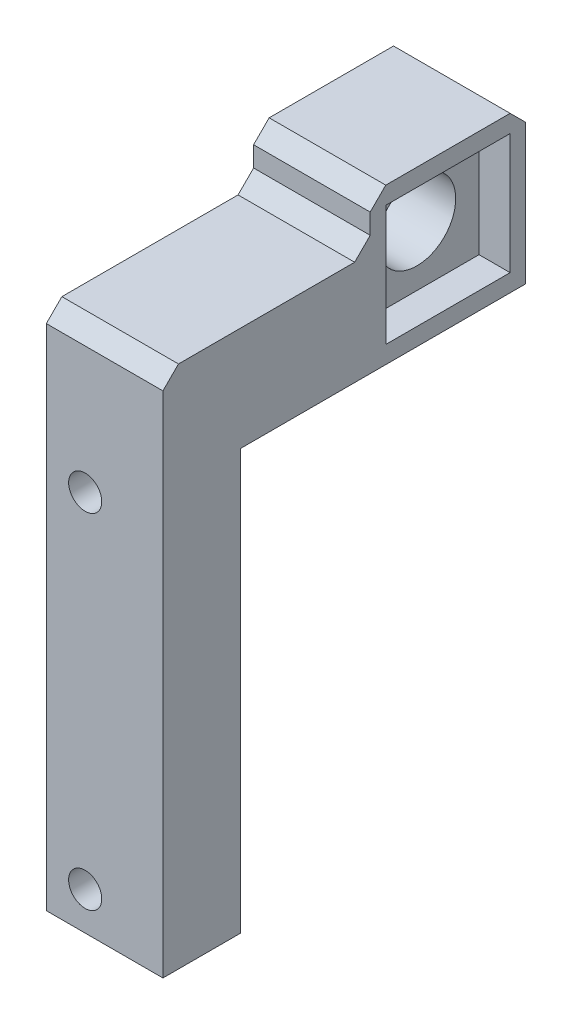
ISO-10303-21;
HEADER;
FILE_DESCRIPTION(('STEP AP214'),'2;1');
FILE_NAME('part.step','',(''),(''),'','','');
FILE_SCHEMA(('AUTOMOTIVE_DESIGN { 1 0 10303 214 1 1 1 1 }'));
ENDSEC;
DATA;
#1=APPLICATION_CONTEXT('core data for automotive mechanical design processes');
#2=APPLICATION_PROTOCOL_DEFINITION('international standard','automotive_design',2000,#1);
#3=PRODUCT_CONTEXT('',#1,'mechanical');
#4=PRODUCT('Part','Part','',(#3));
#5=PRODUCT_RELATED_PRODUCT_CATEGORY('part','',(#4));
#6=PRODUCT_DEFINITION_FORMATION('','',#4);
#7=PRODUCT_DEFINITION_CONTEXT('part definition',#1,'design');
#8=PRODUCT_DEFINITION('design','',#6,#7);
#9=PRODUCT_DEFINITION_SHAPE('','',#8);
#10=(LENGTH_UNIT() NAMED_UNIT(*) SI_UNIT(.MILLI.,.METRE.));
#11=(NAMED_UNIT(*) PLANE_ANGLE_UNIT() SI_UNIT($,.RADIAN.));
#12=(NAMED_UNIT(*) SI_UNIT($,.STERADIAN.) SOLID_ANGLE_UNIT());
#13=UNCERTAINTY_MEASURE_WITH_UNIT(LENGTH_MEASURE(1.E-05),#10,'distance_accuracy_value','');
#14=(GEOMETRIC_REPRESENTATION_CONTEXT(3) GLOBAL_UNCERTAINTY_ASSIGNED_CONTEXT((#13)) GLOBAL_UNIT_ASSIGNED_CONTEXT((#10,
#11,#12)) REPRESENTATION_CONTEXT('',''));
#15=CARTESIAN_POINT('',(0.,0.,0.));
#16=DIRECTION('',(0.,0.,1.));
#17=DIRECTION('',(1.,0.,0.));
#18=AXIS2_PLACEMENT_3D('',#15,#16,#17);
#19=CARTESIAN_POINT('',(0.,0.,13.406799165578));
#20=DIRECTION('',(0.,0.,-1.));
#21=DIRECTION('',(-1.,0.,0.));
#22=AXIS2_PLACEMENT_3D('',#19,#20,#21);
#23=PLANE('',#22);
#24=CARTESIAN_POINT('',(-45.,-22.125,13.406799165578));
#25=DIRECTION('',(0.,0.,1.));
#26=DIRECTION('',(1.,0.,0.));
#27=AXIS2_PLACEMENT_3D('',#24,#25,#26);
#28=CIRCLE('',#27,2.13030000000002);
#29=CARTESIAN_POINT('',(-42.8697,-22.125,13.406799165578));
#30=VERTEX_POINT('',#29);
#31=EDGE_CURVE('E239',#30,#30,#28,.T.);
#32=ORIENTED_EDGE('',*,*,#31,.T.);
#33=EDGE_LOOP('',(#32));
#34=FACE_BOUND('',#33,.T.);
#35=DIRECTION('',(-1.,0.,0.));
#36=VECTOR('',#35,1.);
#37=CARTESIAN_POINT('',(-50.0000000000074,26.9999999999873,13.406799165578));
#38=LINE('',#37,#36);
#39=CARTESIAN_POINT('',(-35.0000000000074,26.9999999999873,13.406799165578));
#40=VERTEX_POINT('',#39);
#41=CARTESIAN_POINT('',(-50.0000000000074,26.9999999999873,13.406799165578));
#42=VERTEX_POINT('',#41);
#43=EDGE_CURVE('E242',#40,#42,#38,.T.);
#44=ORIENTED_EDGE('',*,*,#43,.F.);
#45=DIRECTION('',(0.,1.,0.));
#46=VECTOR('',#45,1.);
#47=CARTESIAN_POINT('',(-35.0000000000074,26.9999999999873,13.406799165578));
#48=LINE('',#47,#46);
#49=CARTESIAN_POINT('',(-35.0000000000074,-27.0000000000127,13.406799165578));
#50=VERTEX_POINT('',#49);
#51=EDGE_CURVE('E256',#50,#40,#48,.T.);
#52=ORIENTED_EDGE('',*,*,#51,.F.);
#53=DIRECTION('',(1.,0.,0.));
#54=VECTOR('',#53,1.);
#55=CARTESIAN_POINT('',(-50.0000000000069,-27.0000000000127,13.406799165578));
#56=LINE('',#55,#54);
#57=CARTESIAN_POINT('',(-50.0000000000069,-27.0000000000127,13.406799165578));
#58=VERTEX_POINT('',#57);
#59=EDGE_CURVE('E232',#58,#50,#56,.T.);
#60=ORIENTED_EDGE('',*,*,#59,.F.);
#61=DIRECTION('',(0.,-1.,0.));
#62=VECTOR('',#61,1.);
#63=CARTESIAN_POINT('',(-50.0000000000074,26.9999999999873,13.406799165578));
#64=LINE('',#63,#62);
#65=EDGE_CURVE('E250',#42,#58,#64,.T.);
#66=ORIENTED_EDGE('',*,*,#65,.F.);
#67=EDGE_LOOP('',(#44,#52,#60,#66));
#68=FACE_BOUND('',#67,.T.);
#69=CARTESIAN_POINT('',(-45.,22.125,13.406799165578));
#70=DIRECTION('',(0.,0.,1.));
#71=DIRECTION('',(1.,0.,0.));
#72=AXIS2_PLACEMENT_3D('',#69,#70,#71);
#73=CIRCLE('',#72,2.13030000000002);
#74=CARTESIAN_POINT('',(-42.8697,22.125,13.406799165578));
#75=VERTEX_POINT('',#74);
#76=EDGE_CURVE('E247',#75,#75,#73,.T.);
#77=ORIENTED_EDGE('',*,*,#76,.T.);
#78=EDGE_LOOP('',(#77));
#79=FACE_BOUND('',#78,.T.);
#80=ADVANCED_FACE('F33',(#34,#68,#79),#23,.T.);
#81=CARTESIAN_POINT('',(-50.0000000000074,26.9999999999873,79.4514242423865));
#82=DIRECTION('',(1.,0.,0.));
#83=DIRECTION('',(0.,1.,0.));
#84=AXIS2_PLACEMENT_3D('',#81,#82,#83);
#85=PLANE('',#84);
#86=DIRECTION('',(0.,1.,0.));
#87=VECTOR('',#86,1.);
#88=CARTESIAN_POINT('',(-50.0000000000074,26.9999999999873,23.4067991655776));
#89=LINE('',#88,#87);
#90=CARTESIAN_POINT('',(-50.0000000000069,-27.0000000000127,23.4067991655776));
#91=VERTEX_POINT('',#90);
#92=CARTESIAN_POINT('',(-50.0000000000075,38.4099403302794,23.4067991655776));
#93=VERTEX_POINT('',#92);
#94=EDGE_CURVE('E246',#91,#93,#89,.T.);
#95=ORIENTED_EDGE('',*,*,#94,.T.);
#96=DIRECTION('',(0.,0.707106781186516,-0.707106781186579));
#97=VECTOR('',#96,1.);
#98=CARTESIAN_POINT('',(-50.0000000000075,38.4099403302794,23.4067991655776));
#99=LINE('',#98,#97);
#100=CARTESIAN_POINT('',(-50.0000000000075,40.4099403302794,21.4067991655774));
#101=VERTEX_POINT('',#100);
#102=EDGE_CURVE('E56',#93,#101,#99,.T.);
#103=ORIENTED_EDGE('',*,*,#102,.T.);
#104=DIRECTION('',(0.,0.,-1.));
#105=VECTOR('',#104,1.);
#106=CARTESIAN_POINT('',(-50.0000000000075,40.4099403302794,23.4067991655776));
#107=LINE('',#106,#105);
#108=CARTESIAN_POINT('',(-50.0000000000075,40.4099403302794,-1.25767630333836));
#109=VERTEX_POINT('',#108);
#110=EDGE_CURVE('E220',#101,#109,#107,.T.);
#111=ORIENTED_EDGE('',*,*,#110,.T.);
#112=DIRECTION('',(0.,-0.707106781186543,0.707106781186552));
#113=VECTOR('',#112,1.);
#114=CARTESIAN_POINT('',(-50.0000000000071,-6.64958010772894,45.8018441346707));
#115=LINE('',#114,#113);
#116=CARTESIAN_POINT('',(-50.0000000000071,42.4099403302794,-3.2576763033384));
#117=VERTEX_POINT('',#116);
#118=EDGE_CURVE('E41',#109,#117,#115,.F.);
#119=ORIENTED_EDGE('',*,*,#118,.T.);
#120=DIRECTION('',(0.,1.,0.));
#121=VECTOR('',#120,1.);
#122=CARTESIAN_POINT('',(-50.0000000000071,26.9999999999892,-3.2576763033384));
#123=LINE('',#122,#121);
#124=CARTESIAN_POINT('',(-50.0000000000073,44.9999999999892,-3.25767630333839));
#125=VERTEX_POINT('',#124);
#126=EDGE_CURVE('E194',#117,#125,#123,.T.);
#127=ORIENTED_EDGE('',*,*,#126,.T.);
#128=DIRECTION('',(0.,-0.707106781186545,0.70710678118655));
#129=VECTOR('',#128,1.);
#130=CARTESIAN_POINT('',(-50.0000000000075,44.9999999999892,-3.25767630333833));
#131=LINE('',#130,#129);
#132=CARTESIAN_POINT('',(-50.0000000000071,46.9999999999892,-5.2576763033384));
#133=VERTEX_POINT('',#132);
#134=EDGE_CURVE('E289',#125,#133,#131,.F.);
#135=ORIENTED_EDGE('',*,*,#134,.T.);
#136=DIRECTION('',(0.,0.,-1.));
#137=VECTOR('',#136,1.);
#138=CARTESIAN_POINT('',(-50.0000000000071,46.9999999999892,-3.2576763033384));
#139=LINE('',#138,#137);
#140=CARTESIAN_POINT('',(-50.0000000000073,46.9999999999892,-21.2576763033384));
#141=VERTEX_POINT('',#140);
#142=EDGE_CURVE('E208',#133,#141,#139,.T.);
#143=ORIENTED_EDGE('',*,*,#142,.T.);
#144=DIRECTION('',(0.,0.70710678118655,0.707106781186545));
#145=VECTOR('',#144,1.);
#146=CARTESIAN_POINT('',(-50.0000000000075,46.9999999999892,-21.2576763033385));
#147=LINE('',#146,#145);
#148=CARTESIAN_POINT('',(-50.0000000000071,44.9999999999892,-23.2576763033384));
#149=VERTEX_POINT('',#148);
#150=EDGE_CURVE('E287',#141,#149,#147,.F.);
#151=ORIENTED_EDGE('',*,*,#150,.T.);
#152=DIRECTION('',(0.,-1.,0.));
#153=VECTOR('',#152,1.);
#154=CARTESIAN_POINT('',(-50.0000000000071,26.9999999999892,-23.2576763033384));
#155=LINE('',#154,#153);
#156=CARTESIAN_POINT('',(-50.0000000000071,26.9999999999892,-23.2576763033384));
#157=VERTEX_POINT('',#156);
#158=EDGE_CURVE('E203',#149,#157,#155,.T.);
#159=ORIENTED_EDGE('',*,*,#158,.T.);
#160=DIRECTION('',(0.,0.,1.));
#161=VECTOR('',#160,1.);
#162=CARTESIAN_POINT('',(-50.0000000000074,26.9999999999873,23.4067991655776));
#163=LINE('',#162,#161);
#164=EDGE_CURVE('E229',#157,#42,#163,.T.);
#165=ORIENTED_EDGE('',*,*,#164,.T.);
#166=ORIENTED_EDGE('',*,*,#65,.T.);
#167=DIRECTION('',(0.,0.,-1.));
#168=VECTOR('',#167,1.);
#169=CARTESIAN_POINT('',(-50.0000000000069,-27.0000000000127,79.4514242423865));
#170=LINE('',#169,#168);
#171=EDGE_CURVE('E236',#91,#58,#170,.T.);
#172=ORIENTED_EDGE('',*,*,#171,.F.);
#173=EDGE_LOOP('',(#95,#103,#111,#119,#127,#135,#143,#151,#159,#165,#166,#172));
#174=FACE_BOUND('',#173,.T.);
#175=CARTESIAN_POINT('',(-50.0000000000071,36.9999999999892,-13.2576763033384));
#176=DIRECTION('',(-1.,0.,0.));
#177=DIRECTION('',(0.,0.,1.));
#178=AXIS2_PLACEMENT_3D('',#175,#176,#177);
#179=CIRCLE('',#178,4.99999999999975);
#180=CARTESIAN_POINT('',(-50.0000000000071,36.9999999999892,-8.25767630333865));
#181=VERTEX_POINT('',#180);
#182=EDGE_CURVE('E191',#181,#181,#179,.T.);
#183=ORIENTED_EDGE('',*,*,#182,.F.);
#184=EDGE_LOOP('',(#183));
#185=FACE_BOUND('',#184,.T.);
#186=ADVANCED_FACE('F313',(#174,#185),#85,.F.);
#187=CARTESIAN_POINT('',(-50.0000000000069,-27.0000000000127,79.4514242423865));
#188=DIRECTION('',(0.,1.,0.));
#189=DIRECTION('',(0.,0.,1.));
#190=AXIS2_PLACEMENT_3D('',#187,#188,#189);
#191=PLANE('',#190);
#192=DIRECTION('',(0.,0.,-1.));
#193=VECTOR('',#192,1.);
#194=CARTESIAN_POINT('',(-35.0000000000074,-27.0000000000127,79.4514242423865));
#195=LINE('',#194,#193);
#196=CARTESIAN_POINT('',(-35.0000000000074,-27.0000000000127,23.4067991655776));
#197=VERTEX_POINT('',#196);
#198=EDGE_CURVE('E258',#197,#50,#195,.T.);
#199=ORIENTED_EDGE('',*,*,#198,.F.);
#200=DIRECTION('',(-1.,0.,0.));
#201=VECTOR('',#200,1.);
#202=CARTESIAN_POINT('',(-50.0000000000069,-27.0000000000127,23.4067991655776));
#203=LINE('',#202,#201);
#204=EDGE_CURVE('E253',#197,#91,#203,.T.);
#205=ORIENTED_EDGE('',*,*,#204,.T.);
#206=ORIENTED_EDGE('',*,*,#171,.T.);
#207=ORIENTED_EDGE('',*,*,#59,.T.);
#208=EDGE_LOOP('',(#199,#205,#206,#207));
#209=FACE_BOUND('',#208,.T.);
#210=ADVANCED_FACE('F319',(#209),#191,.F.);
#211=CARTESIAN_POINT('',(-35.0000000000074,26.9999999999873,79.4514242423865));
#212=DIRECTION('',(-1.,0.,0.));
#213=DIRECTION('',(0.,-1.,0.));
#214=AXIS2_PLACEMENT_3D('',#211,#212,#213);
#215=PLANE('',#214);
#216=DIRECTION('',(0.,0.,-1.));
#217=VECTOR('',#216,1.);
#218=CARTESIAN_POINT('',(-35.0000000000074,29.2499999999884,-5.2576763033384));
#219=LINE('',#218,#217);
#220=CARTESIAN_POINT('',(-35.0000000000074,29.2499999999884,-5.2576763033384));
#221=VERTEX_POINT('',#220);
#222=CARTESIAN_POINT('',(-35.0000000000074,29.2499999999884,-21.2576763033384));
#223=VERTEX_POINT('',#222);
#224=EDGE_CURVE('E181',#221,#223,#219,.T.);
#225=ORIENTED_EDGE('',*,*,#224,.F.);
#226=DIRECTION('',(0.,-1.,0.));
#227=VECTOR('',#226,1.);
#228=CARTESIAN_POINT('',(-35.0000000000074,29.2499999999884,-5.2576763033384));
#229=LINE('',#228,#227);
#230=CARTESIAN_POINT('',(-35.0000000000074,44.7499999999884,-5.2576763033384));
#231=VERTEX_POINT('',#230);
#232=EDGE_CURVE('E154',#231,#221,#229,.T.);
#233=ORIENTED_EDGE('',*,*,#232,.F.);
#234=DIRECTION('',(0.,0.,1.));
#235=VECTOR('',#234,1.);
#236=CARTESIAN_POINT('',(-35.0000000000074,44.7499999999884,-5.2576763033384));
#237=LINE('',#236,#235);
#238=CARTESIAN_POINT('',(-35.0000000000074,44.7499999999884,-21.2576763033384));
#239=VERTEX_POINT('',#238);
#240=EDGE_CURVE('E172',#239,#231,#237,.T.);
#241=ORIENTED_EDGE('',*,*,#240,.F.);
#242=DIRECTION('',(0.,1.,0.));
#243=VECTOR('',#242,1.);
#244=CARTESIAN_POINT('',(-35.0000000000074,29.2499999999884,-21.2576763033384));
#245=LINE('',#244,#243);
#246=EDGE_CURVE('E175',#223,#239,#245,.T.);
#247=ORIENTED_EDGE('',*,*,#246,.F.);
#248=EDGE_LOOP('',(#225,#233,#241,#247));
#249=FACE_BOUND('',#248,.T.);
#250=DIRECTION('',(0.,0.,1.));
#251=VECTOR('',#250,1.);
#252=CARTESIAN_POINT('',(-35.0000000000074,40.4099403302796,23.4067991655776));
#253=LINE('',#252,#251);
#254=CARTESIAN_POINT('',(-35.0000000000074,40.4099403302796,-1.25767630333837));
#255=VERTEX_POINT('',#254);
#256=CARTESIAN_POINT('',(-35.0000000000074,40.4099403302796,21.4067991655774));
#257=VERTEX_POINT('',#256);
#258=EDGE_CURVE('E228',#255,#257,#253,.T.);
#259=ORIENTED_EDGE('',*,*,#258,.T.);
#260=DIRECTION('',(0.,-0.707106781186516,0.707106781186579));
#261=VECTOR('',#260,1.);
#262=CARTESIAN_POINT('',(-35.0000000000074,38.4099403302798,23.4067991655773));
#263=LINE('',#262,#261);
#264=CARTESIAN_POINT('',(-35.0000000000074,38.4099403302795,23.4067991655776));
#265=VERTEX_POINT('',#264);
#266=EDGE_CURVE('E48',#257,#265,#263,.T.);
#267=ORIENTED_EDGE('',*,*,#266,.T.);
#268=DIRECTION('',(0.,-1.,0.));
#269=VECTOR('',#268,1.);
#270=CARTESIAN_POINT('',(-35.0000000000074,26.9999999999873,23.4067991655776));
#271=LINE('',#270,#269);
#272=EDGE_CURVE('E235',#265,#197,#271,.T.);
#273=ORIENTED_EDGE('',*,*,#272,.T.);
#274=ORIENTED_EDGE('',*,*,#198,.T.);
#275=ORIENTED_EDGE('',*,*,#51,.T.);
#276=DIRECTION('',(0.,0.,-1.));
#277=VECTOR('',#276,1.);
#278=CARTESIAN_POINT('',(-35.0000000000074,26.9999999999875,23.4067991655776));
#279=LINE('',#278,#277);
#280=CARTESIAN_POINT('',(-35.0000000000071,26.9999999999892,-23.2576763033384));
#281=VERTEX_POINT('',#280);
#282=EDGE_CURVE('E225',#40,#281,#279,.T.);
#283=ORIENTED_EDGE('',*,*,#282,.T.);
#284=DIRECTION('',(0.,-1.,0.));
#285=VECTOR('',#284,1.);
#286=CARTESIAN_POINT('',(-35.0000000000071,26.9999999999892,-23.2576763033384));
#287=LINE('',#286,#285);
#288=CARTESIAN_POINT('',(-35.0000000000072,44.9999999999892,-23.2576763033384));
#289=VERTEX_POINT('',#288);
#290=EDGE_CURVE('E213',#289,#281,#287,.T.);
#291=ORIENTED_EDGE('',*,*,#290,.F.);
#292=DIRECTION('',(0.,-0.70710678118655,-0.707106781186545));
#293=VECTOR('',#292,1.);
#294=CARTESIAN_POINT('',(-35.0000000000074,46.9999999999892,-21.2576763033384));
#295=LINE('',#294,#293);
#296=CARTESIAN_POINT('',(-35.0000000000072,46.9999999999892,-21.2576763033384));
#297=VERTEX_POINT('',#296);
#298=EDGE_CURVE('E276',#289,#297,#295,.F.);
#299=ORIENTED_EDGE('',*,*,#298,.T.);
#300=DIRECTION('',(0.,0.,-1.));
#301=VECTOR('',#300,1.);
#302=CARTESIAN_POINT('',(-35.0000000000071,46.9999999999892,-3.2576763033384));
#303=LINE('',#302,#301);
#304=CARTESIAN_POINT('',(-35.0000000000072,46.9999999999892,-5.2576763033384));
#305=VERTEX_POINT('',#304);
#306=EDGE_CURVE('E197',#305,#297,#303,.T.);
#307=ORIENTED_EDGE('',*,*,#306,.F.);
#308=DIRECTION('',(0.,0.707106781186545,-0.70710678118655));
#309=VECTOR('',#308,1.);
#310=CARTESIAN_POINT('',(-35.0000000000074,44.9999999999893,-3.2576763033384));
#311=LINE('',#310,#309);
#312=CARTESIAN_POINT('',(-35.0000000000072,44.9999999999893,-3.2576763033384));
#313=VERTEX_POINT('',#312);
#314=EDGE_CURVE('E280',#305,#313,#311,.F.);
#315=ORIENTED_EDGE('',*,*,#314,.T.);
#316=DIRECTION('',(0.,1.,0.));
#317=VECTOR('',#316,1.);
#318=CARTESIAN_POINT('',(-35.0000000000071,26.9999999999892,-3.2576763033384));
#319=LINE('',#318,#317);
#320=CARTESIAN_POINT('',(-35.0000000000071,42.4099403302796,-3.2576763033384));
#321=VERTEX_POINT('',#320);
#322=EDGE_CURVE('E200',#321,#313,#319,.T.);
#323=ORIENTED_EDGE('',*,*,#322,.F.);
#324=DIRECTION('',(0.,0.707106781186543,-0.707106781186552));
#325=VECTOR('',#324,1.);
#326=CARTESIAN_POINT('',(-35.0000000000074,-6.64958010772887,45.8018441346707));
#327=LINE('',#326,#325);
#328=EDGE_CURVE('E11',#321,#255,#327,.F.);
#329=ORIENTED_EDGE('',*,*,#328,.T.);
#330=EDGE_LOOP('',(#259,#267,#273,#274,#275,#283,#291,#299,#307,#315,#323,#329));
#331=FACE_BOUND('',#330,.T.);
#332=ADVANCED_FACE('F328',(#249,#331),#215,.F.);
#333=CARTESIAN_POINT('',(-45.,-22.125,79.4514242423865));
#334=DIRECTION('',(0.,0.,-1.));
#335=DIRECTION('',(-1.,0.,0.));
#336=AXIS2_PLACEMENT_3D('',#333,#334,#335);
#337=CYLINDRICAL_SURFACE('',#336,2.13030000000002);
#338=CARTESIAN_POINT('',(-45.,-22.125,23.4067991655776));
#339=DIRECTION('',(0.,0.,-1.00000000000003));
#340=DIRECTION('',(-1.,0.,0.));
#341=AXIS2_PLACEMENT_3D('',#338,#339,#340);
#342=CIRCLE('',#341,2.13030000000002);
#343=CARTESIAN_POINT('',(-47.1303,-22.125,23.4067991655776));
#344=VERTEX_POINT('',#343);
#345=EDGE_CURVE('E295',#344,#344,#342,.T.);
#346=ORIENTED_EDGE('',*,*,#345,.F.);
#347=EDGE_LOOP('',(#346));
#348=FACE_BOUND('',#347,.T.);
#349=ORIENTED_EDGE('',*,*,#31,.F.);
#350=EDGE_LOOP('',(#349));
#351=FACE_BOUND('',#350,.T.);
#352=ADVANCED_FACE('F331',(#348,#351),#337,.F.);
#353=CARTESIAN_POINT('',(-45.,22.125,79.4514242423865));
#354=DIRECTION('',(0.,0.,-1.));
#355=DIRECTION('',(-1.,0.,0.));
#356=AXIS2_PLACEMENT_3D('',#353,#354,#355);
#357=CYLINDRICAL_SURFACE('',#356,2.13030000000002);
#358=CARTESIAN_POINT('',(-45.,22.125,23.4067991655776));
#359=DIRECTION('',(0.,0.,-1.00000000000003));
#360=DIRECTION('',(-1.,0.,0.));
#361=AXIS2_PLACEMENT_3D('',#358,#359,#360);
#362=CIRCLE('',#361,2.13030000000002);
#363=CARTESIAN_POINT('',(-47.1303,22.125,23.4067991655776));
#364=VERTEX_POINT('',#363);
#365=EDGE_CURVE('E248',#364,#364,#362,.T.);
#366=ORIENTED_EDGE('',*,*,#365,.F.);
#367=EDGE_LOOP('',(#366));
#368=FACE_BOUND('',#367,.T.);
#369=ORIENTED_EDGE('',*,*,#76,.F.);
#370=EDGE_LOOP('',(#369));
#371=FACE_BOUND('',#370,.T.);
#372=ADVANCED_FACE('F338',(#368,#371),#357,.F.);
#373=CARTESIAN_POINT('',(29.9999999999958,-27.0000000000119,23.4067991655776));
#374=DIRECTION('',(0.,0.,-1.00000000000003));
#375=DIRECTION('',(0.,-1.,0.));
#376=AXIS2_PLACEMENT_3D('',#373,#374,#375);
#377=PLANE('',#376);
#378=ORIENTED_EDGE('',*,*,#365,.T.);
#379=EDGE_LOOP('',(#378));
#380=FACE_BOUND('',#379,.T.);
#381=ORIENTED_EDGE('',*,*,#345,.T.);
#382=EDGE_LOOP('',(#381));
#383=FACE_BOUND('',#382,.T.);
#384=ORIENTED_EDGE('',*,*,#272,.F.);
#385=DIRECTION('',(-1.,0.,0.));
#386=VECTOR('',#385,1.);
#387=CARTESIAN_POINT('',(-50.0000000000075,38.4099403302794,23.4067991655776));
#388=LINE('',#387,#386);
#389=EDGE_CURVE('E384',#265,#93,#388,.T.);
#390=ORIENTED_EDGE('',*,*,#389,.T.);
#391=ORIENTED_EDGE('',*,*,#94,.F.);
#392=ORIENTED_EDGE('',*,*,#204,.F.);
#393=EDGE_LOOP('',(#384,#390,#391,#392));
#394=FACE_BOUND('',#393,.T.);
#395=ADVANCED_FACE('F342',(#380,#383,#394),#377,.F.);
#396=CARTESIAN_POINT('',(-5.15337955992369,26.9999999999877,23.4067991655776));
#397=DIRECTION('',(0.,-1.,0.));
#398=DIRECTION('',(1.,0.,0.));
#399=AXIS2_PLACEMENT_3D('',#396,#397,#398);
#400=PLANE('',#399);
#401=ORIENTED_EDGE('',*,*,#282,.F.);
#402=ORIENTED_EDGE('',*,*,#43,.T.);
#403=ORIENTED_EDGE('',*,*,#164,.F.);
#404=DIRECTION('',(-1.,0.,0.));
#405=VECTOR('',#404,1.);
#406=CARTESIAN_POINT('',(-35.0000000000071,26.9999999999892,-23.2576763033384));
#407=LINE('',#406,#405);
#408=EDGE_CURVE('E217',#281,#157,#407,.T.);
#409=ORIENTED_EDGE('',*,*,#408,.F.);
#410=EDGE_LOOP('',(#401,#402,#403,#409));
#411=FACE_BOUND('',#410,.T.);
#412=ADVANCED_FACE('F346',(#411),#400,.T.);
#413=CARTESIAN_POINT('',(-5.15337955992382,40.4099403302798,23.4067991655776));
#414=DIRECTION('',(0.,1.,0.));
#415=DIRECTION('',(-1.,0.,0.));
#416=AXIS2_PLACEMENT_3D('',#413,#414,#415);
#417=PLANE('',#416);
#418=ORIENTED_EDGE('',*,*,#258,.F.);
#419=DIRECTION('',(-1.,0.,0.));
#420=VECTOR('',#419,1.);
#421=CARTESIAN_POINT('',(-50.0000000000075,40.4099403302794,-1.25767630333837));
#422=LINE('',#421,#420);
#423=EDGE_CURVE('E204',#255,#109,#422,.T.);
#424=ORIENTED_EDGE('',*,*,#423,.T.);
#425=ORIENTED_EDGE('',*,*,#110,.F.);
#426=DIRECTION('',(1.,0.,0.));
#427=VECTOR('',#426,1.);
#428=CARTESIAN_POINT('',(-35.0000000000074,40.4099403302796,21.4067991655774));
#429=LINE('',#428,#427);
#430=EDGE_CURVE('E269',#101,#257,#429,.T.);
#431=ORIENTED_EDGE('',*,*,#430,.T.);
#432=EDGE_LOOP('',(#418,#424,#425,#431));
#433=FACE_BOUND('',#432,.T.);
#434=ADVANCED_FACE('F326',(#433),#417,.T.);
#435=CARTESIAN_POINT('',(-35.0000000000071,26.9999999999892,-3.2576763033384));
#436=DIRECTION('',(0.,0.,1.));
#437=DIRECTION('',(1.,0.,0.));
#438=AXIS2_PLACEMENT_3D('',#435,#436,#437);
#439=PLANE('',#438);
#440=ORIENTED_EDGE('',*,*,#126,.F.);
#441=DIRECTION('',(1.,0.,0.));
#442=VECTOR('',#441,1.);
#443=CARTESIAN_POINT('',(-35.0000000000074,42.4099403302796,-3.2576763033384));
#444=LINE('',#443,#442);
#445=EDGE_CURVE('E209',#117,#321,#444,.T.);
#446=ORIENTED_EDGE('',*,*,#445,.T.);
#447=ORIENTED_EDGE('',*,*,#322,.T.);
#448=DIRECTION('',(-1.,0.,0.));
#449=VECTOR('',#448,1.);
#450=CARTESIAN_POINT('',(-35.0000000000071,44.9999999999893,-3.2576763033384));
#451=LINE('',#450,#449);
#452=EDGE_CURVE('E270',#313,#125,#451,.T.);
#453=ORIENTED_EDGE('',*,*,#452,.T.);
#454=EDGE_LOOP('',(#440,#446,#447,#453));
#455=FACE_BOUND('',#454,.T.);
#456=ADVANCED_FACE('F390',(#455),#439,.T.);
#457=CARTESIAN_POINT('',(-35.0000000000071,26.9999999999892,-23.2576763033384));
#458=DIRECTION('',(0.,0.,-1.));
#459=DIRECTION('',(0.,1.,0.));
#460=AXIS2_PLACEMENT_3D('',#457,#458,#459);
#461=PLANE('',#460);
#462=ORIENTED_EDGE('',*,*,#158,.F.);
#463=DIRECTION('',(1.,0.,0.));
#464=VECTOR('',#463,1.);
#465=CARTESIAN_POINT('',(-35.0000000000071,44.9999999999892,-23.2576763033384));
#466=LINE('',#465,#464);
#467=EDGE_CURVE('E285',#149,#289,#466,.T.);
#468=ORIENTED_EDGE('',*,*,#467,.T.);
#469=ORIENTED_EDGE('',*,*,#290,.T.);
#470=ORIENTED_EDGE('',*,*,#408,.T.);
#471=EDGE_LOOP('',(#462,#468,#469,#470));
#472=FACE_BOUND('',#471,.T.);
#473=ADVANCED_FACE('F403',(#472),#461,.T.);
#474=CARTESIAN_POINT('',(-35.0000000000071,46.9999999999892,-3.2576763033384));
#475=DIRECTION('',(0.,1.,0.));
#476=DIRECTION('',(0.,0.,1.));
#477=AXIS2_PLACEMENT_3D('',#474,#475,#476);
#478=PLANE('',#477);
#479=ORIENTED_EDGE('',*,*,#306,.T.);
#480=DIRECTION('',(-1.,0.,0.));
#481=VECTOR('',#480,1.);
#482=CARTESIAN_POINT('',(-35.0000000000071,46.9999999999892,-21.2576763033384));
#483=LINE('',#482,#481);
#484=EDGE_CURVE('E291',#297,#141,#483,.T.);
#485=ORIENTED_EDGE('',*,*,#484,.T.);
#486=ORIENTED_EDGE('',*,*,#142,.F.);
#487=DIRECTION('',(1.,0.,0.));
#488=VECTOR('',#487,1.);
#489=CARTESIAN_POINT('',(-35.0000000000071,46.9999999999892,-5.2576763033384));
#490=LINE('',#489,#488);
#491=EDGE_CURVE('E294',#133,#305,#490,.T.);
#492=ORIENTED_EDGE('',*,*,#491,.T.);
#493=EDGE_LOOP('',(#479,#485,#486,#492));
#494=FACE_BOUND('',#493,.T.);
#495=ADVANCED_FACE('F309',(#494),#478,.T.);
#496=CARTESIAN_POINT('',(-35.0000000000071,36.9999999999892,-13.2576763033384));
#497=DIRECTION('',(-1.,0.,0.));
#498=DIRECTION('',(0.,0.,1.));
#499=AXIS2_PLACEMENT_3D('',#496,#497,#498);
#500=CYLINDRICAL_SURFACE('',#499,4.99999999999975);
#501=CARTESIAN_POINT('',(-39.0000000000074,36.9999999999892,-13.2576763033384));
#502=DIRECTION('',(-1.,0.,0.));
#503=DIRECTION('',(0.,0.,1.));
#504=AXIS2_PLACEMENT_3D('',#501,#502,#503);
#505=CIRCLE('',#504,4.99999999999975);
#506=CARTESIAN_POINT('',(-39.0000000000074,36.9999999999892,-8.25767630333865));
#507=VERTEX_POINT('',#506);
#508=EDGE_CURVE('E187',#507,#507,#505,.F.);
#509=ORIENTED_EDGE('',*,*,#508,.T.);
#510=EDGE_LOOP('',(#509));
#511=FACE_BOUND('',#510,.T.);
#512=ORIENTED_EDGE('',*,*,#182,.T.);
#513=EDGE_LOOP('',(#512));
#514=FACE_BOUND('',#513,.T.);
#515=ADVANCED_FACE('F299',(#511,#514),#500,.F.);
#516=CARTESIAN_POINT('',(-39.0000000000074,0.,0.));
#517=DIRECTION('',(-1.,0.,0.));
#518=DIRECTION('',(0.,0.,1.));
#519=AXIS2_PLACEMENT_3D('',#516,#517,#518);
#520=PLANE('',#519);
#521=DIRECTION('',(0.,-1.,0.));
#522=VECTOR('',#521,1.);
#523=CARTESIAN_POINT('',(-39.0000000000074,29.2499999999884,-5.2576763033384));
#524=LINE('',#523,#522);
#525=CARTESIAN_POINT('',(-39.0000000000074,44.7499999999884,-5.2576763033384));
#526=VERTEX_POINT('',#525);
#527=CARTESIAN_POINT('',(-39.0000000000074,29.2499999999884,-5.2576763033384));
#528=VERTEX_POINT('',#527);
#529=EDGE_CURVE('E151',#526,#528,#524,.T.);
#530=ORIENTED_EDGE('',*,*,#529,.T.);
#531=DIRECTION('',(0.,0.,-1.));
#532=VECTOR('',#531,1.);
#533=CARTESIAN_POINT('',(-39.0000000000074,29.2499999999884,-5.2576763033384));
#534=LINE('',#533,#532);
#535=CARTESIAN_POINT('',(-39.0000000000074,29.2499999999884,-21.2576763033384));
#536=VERTEX_POINT('',#535);
#537=EDGE_CURVE('E162',#528,#536,#534,.T.);
#538=ORIENTED_EDGE('',*,*,#537,.T.);
#539=DIRECTION('',(0.,1.,0.));
#540=VECTOR('',#539,1.);
#541=CARTESIAN_POINT('',(-39.0000000000074,29.2499999999884,-21.2576763033384));
#542=LINE('',#541,#540);
#543=CARTESIAN_POINT('',(-39.0000000000074,44.7499999999884,-21.2576763033384));
#544=VERTEX_POINT('',#543);
#545=EDGE_CURVE('E167',#536,#544,#542,.T.);
#546=ORIENTED_EDGE('',*,*,#545,.T.);
#547=DIRECTION('',(0.,0.,1.));
#548=VECTOR('',#547,1.);
#549=CARTESIAN_POINT('',(-39.0000000000074,44.7499999999884,-5.2576763033384));
#550=LINE('',#549,#548);
#551=EDGE_CURVE('E159',#544,#526,#550,.T.);
#552=ORIENTED_EDGE('',*,*,#551,.T.);
#553=EDGE_LOOP('',(#530,#538,#546,#552));
#554=FACE_BOUND('',#553,.T.);
#555=ORIENTED_EDGE('',*,*,#508,.F.);
#556=EDGE_LOOP('',(#555));
#557=FACE_BOUND('',#556,.T.);
#558=ADVANCED_FACE('F169',(#554,#557),#520,.F.);
#559=CARTESIAN_POINT('',(-39.0000000000074,29.2499999999884,-5.2576763033384));
#560=DIRECTION('',(0.,0.,1.));
#561=DIRECTION('',(1.,0.,0.));
#562=AXIS2_PLACEMENT_3D('',#559,#560,#561);
#563=PLANE('',#562);
#564=ORIENTED_EDGE('',*,*,#232,.T.);
#565=DIRECTION('',(1.,0.,0.));
#566=VECTOR('',#565,1.);
#567=CARTESIAN_POINT('',(-39.0000000000074,29.2499999999884,-5.2576763033384));
#568=LINE('',#567,#566);
#569=EDGE_CURVE('E147',#528,#221,#568,.T.);
#570=ORIENTED_EDGE('',*,*,#569,.F.);
#571=ORIENTED_EDGE('',*,*,#529,.F.);
#572=DIRECTION('',(1.,0.,0.));
#573=VECTOR('',#572,1.);
#574=CARTESIAN_POINT('',(-39.0000000000074,44.7499999999884,-5.2576763033384));
#575=LINE('',#574,#573);
#576=EDGE_CURVE('E185',#526,#231,#575,.T.);
#577=ORIENTED_EDGE('',*,*,#576,.T.);
#578=EDGE_LOOP('',(#564,#570,#571,#577));
#579=FACE_BOUND('',#578,.T.);
#580=ADVANCED_FACE('F149',(#579),#563,.F.);
#581=CARTESIAN_POINT('',(-39.0000000000074,44.7499999999884,-5.2576763033384));
#582=DIRECTION('',(0.,1.,0.));
#583=DIRECTION('',(0.,0.,1.));
#584=AXIS2_PLACEMENT_3D('',#581,#582,#583);
#585=PLANE('',#584);
#586=ORIENTED_EDGE('',*,*,#240,.T.);
#587=ORIENTED_EDGE('',*,*,#576,.F.);
#588=ORIENTED_EDGE('',*,*,#551,.F.);
#589=DIRECTION('',(1.,0.,0.));
#590=VECTOR('',#589,1.);
#591=CARTESIAN_POINT('',(-39.0000000000074,44.7499999999884,-21.2576763033384));
#592=LINE('',#591,#590);
#593=EDGE_CURVE('E188',#544,#239,#592,.T.);
#594=ORIENTED_EDGE('',*,*,#593,.T.);
#595=EDGE_LOOP('',(#586,#587,#588,#594));
#596=FACE_BOUND('',#595,.T.);
#597=ADVANCED_FACE('F307',(#596),#585,.F.);
#598=CARTESIAN_POINT('',(-39.0000000000074,29.2499999999884,-21.2576763033384));
#599=DIRECTION('',(0.,0.,-1.));
#600=DIRECTION('',(-1.,0.,0.));
#601=AXIS2_PLACEMENT_3D('',#598,#599,#600);
#602=PLANE('',#601);
#603=ORIENTED_EDGE('',*,*,#246,.T.);
#604=ORIENTED_EDGE('',*,*,#593,.F.);
#605=ORIENTED_EDGE('',*,*,#545,.F.);
#606=DIRECTION('',(1.,0.,0.));
#607=VECTOR('',#606,1.);
#608=CARTESIAN_POINT('',(-39.0000000000074,29.2499999999884,-21.2576763033384));
#609=LINE('',#608,#607);
#610=EDGE_CURVE('E158',#536,#223,#609,.T.);
#611=ORIENTED_EDGE('',*,*,#610,.T.);
#612=EDGE_LOOP('',(#603,#604,#605,#611));
#613=FACE_BOUND('',#612,.T.);
#614=ADVANCED_FACE('F425',(#613),#602,.F.);
#615=CARTESIAN_POINT('',(-39.0000000000074,29.2499999999884,-5.2576763033384));
#616=DIRECTION('',(0.,-1.,0.));
#617=DIRECTION('',(0.,0.,-1.));
#618=AXIS2_PLACEMENT_3D('',#615,#616,#617);
#619=PLANE('',#618);
#620=ORIENTED_EDGE('',*,*,#224,.T.);
#621=ORIENTED_EDGE('',*,*,#610,.F.);
#622=ORIENTED_EDGE('',*,*,#537,.F.);
#623=ORIENTED_EDGE('',*,*,#569,.T.);
#624=EDGE_LOOP('',(#620,#621,#622,#623));
#625=FACE_BOUND('',#624,.T.);
#626=ADVANCED_FACE('F163',(#625),#619,.F.);
#627=CARTESIAN_POINT('',(-35.0000000000071,46.9999999999892,-21.2576763033384));
#628=DIRECTION('',(0.,-0.707106781186545,0.70710678118655));
#629=DIRECTION('',(-1.,0.,0.));
#630=AXIS2_PLACEMENT_3D('',#627,#628,#629);
#631=PLANE('',#630);
#632=ORIENTED_EDGE('',*,*,#298,.F.);
#633=ORIENTED_EDGE('',*,*,#467,.F.);
#634=ORIENTED_EDGE('',*,*,#150,.F.);
#635=ORIENTED_EDGE('',*,*,#484,.F.);
#636=EDGE_LOOP('',(#632,#633,#634,#635));
#637=FACE_BOUND('',#636,.T.);
#638=ADVANCED_FACE('F348',(#637),#631,.F.);
#639=CARTESIAN_POINT('',(-35.0000000000071,44.9999999999893,-3.2576763033384));
#640=DIRECTION('',(0.,-0.70710678118655,-0.707106781186545));
#641=DIRECTION('',(-1.,0.,0.));
#642=AXIS2_PLACEMENT_3D('',#639,#640,#641);
#643=PLANE('',#642);
#644=ORIENTED_EDGE('',*,*,#314,.F.);
#645=ORIENTED_EDGE('',*,*,#491,.F.);
#646=ORIENTED_EDGE('',*,*,#134,.F.);
#647=ORIENTED_EDGE('',*,*,#452,.F.);
#648=EDGE_LOOP('',(#644,#645,#646,#647));
#649=FACE_BOUND('',#648,.T.);
#650=ADVANCED_FACE('F351',(#649),#643,.F.);
#651=CARTESIAN_POINT('',(-5.15337955992382,40.4099403302798,-1.25767630333837));
#652=DIRECTION('',(0.,0.707106781186552,0.707106781186543));
#653=DIRECTION('',(1.,0.,0.));
#654=AXIS2_PLACEMENT_3D('',#651,#652,#653);
#655=PLANE('',#654);
#656=ORIENTED_EDGE('',*,*,#328,.F.);
#657=ORIENTED_EDGE('',*,*,#445,.F.);
#658=ORIENTED_EDGE('',*,*,#118,.F.);
#659=ORIENTED_EDGE('',*,*,#423,.F.);
#660=EDGE_LOOP('',(#656,#657,#658,#659));
#661=FACE_BOUND('',#660,.T.);
#662=ADVANCED_FACE('F354',(#661),#655,.T.);
#663=CARTESIAN_POINT('',(29.9999999999952,38.4099403302801,23.4067991655776));
#664=DIRECTION('',(0.,0.707106781186579,0.707106781186516));
#665=DIRECTION('',(1.,0.,0.));
#666=AXIS2_PLACEMENT_3D('',#663,#664,#665);
#667=PLANE('',#666);
#668=ORIENTED_EDGE('',*,*,#266,.F.);
#669=ORIENTED_EDGE('',*,*,#430,.F.);
#670=ORIENTED_EDGE('',*,*,#102,.F.);
#671=ORIENTED_EDGE('',*,*,#389,.F.);
#672=EDGE_LOOP('',(#668,#669,#670,#671));
#673=FACE_BOUND('',#672,.T.);
#674=ADVANCED_FACE('F35',(#673),#667,.T.);
#675=CLOSED_SHELL('',(#80,#186,#210,#332,#352,#372,#395,#412,#434,#456,#473,#495,#515,#558,#580,
#597,#614,#626,#638,#650,#662,#674));
#676=MANIFOLD_SOLID_BREP('B2',#675);
#677=ADVANCED_BREP_SHAPE_REPRESENTATION('',(#18,#676),#14);
#678=SHAPE_DEFINITION_REPRESENTATION(#9,#677);
ENDSEC;
END-ISO-10303-21;
